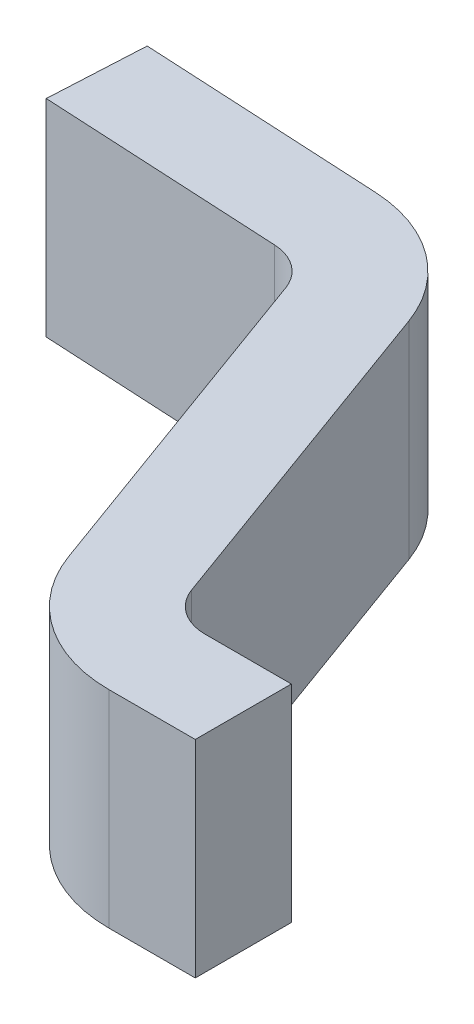
ISO-10303-21;
HEADER;
FILE_DESCRIPTION(('STEP AP214'),'2;1');
FILE_NAME('part.step','',(''),(''),'','','');
FILE_SCHEMA(('AUTOMOTIVE_DESIGN { 1 0 10303 214 1 1 1 1 }'));
ENDSEC;
DATA;
#1=APPLICATION_CONTEXT('core data for automotive mechanical design processes');
#2=APPLICATION_PROTOCOL_DEFINITION('international standard','automotive_design',2000,#1);
#3=PRODUCT_CONTEXT('',#1,'mechanical');
#4=PRODUCT('Part','Part','',(#3));
#5=PRODUCT_RELATED_PRODUCT_CATEGORY('part','',(#4));
#6=PRODUCT_DEFINITION_FORMATION('','',#4);
#7=PRODUCT_DEFINITION_CONTEXT('part definition',#1,'design');
#8=PRODUCT_DEFINITION('design','',#6,#7);
#9=PRODUCT_DEFINITION_SHAPE('','',#8);
#10=(LENGTH_UNIT() NAMED_UNIT(*) SI_UNIT(.MILLI.,.METRE.));
#11=(NAMED_UNIT(*) PLANE_ANGLE_UNIT() SI_UNIT($,.RADIAN.));
#12=(NAMED_UNIT(*) SI_UNIT($,.STERADIAN.) SOLID_ANGLE_UNIT());
#13=UNCERTAINTY_MEASURE_WITH_UNIT(LENGTH_MEASURE(1.E-05),#10,'distance_accuracy_value','');
#14=(GEOMETRIC_REPRESENTATION_CONTEXT(3) GLOBAL_UNCERTAINTY_ASSIGNED_CONTEXT((#13)) GLOBAL_UNIT_ASSIGNED_CONTEXT((#10,
#11,#12)) REPRESENTATION_CONTEXT('',''));
#15=CARTESIAN_POINT('',(0.,0.,0.));
#16=DIRECTION('',(0.,0.,1.));
#17=DIRECTION('',(1.,0.,0.));
#18=AXIS2_PLACEMENT_3D('',#15,#16,#17);
#19=CARTESIAN_POINT('',(0.48600567211583,0.,0.323785336125864));
#20=DIRECTION('',(0.,-1.,0.));
#21=DIRECTION('',(0.,0.,-1.));
#22=AXIS2_PLACEMENT_3D('',#19,#20,#21);
#23=PLANE('',#22);
#24=DIRECTION('',(0.998629534754574,0.,0.052335956242944));
#25=VECTOR('',#24,1.);
#26=CARTESIAN_POINT('',(0.491239267740124,0.,0.223922382650406));
#27=LINE('',#26,#25);
#28=CARTESIAN_POINT('',(-0.010467191248589,0.,0.19762906128285));
#29=VERTEX_POINT('',#28);
#30=CARTESIAN_POINT('',(0.491239267740124,0.,0.223922382650406));
#31=VERTEX_POINT('',#30);
#32=EDGE_CURVE('E280',#29,#31,#27,.T.);
#33=ORIENTED_EDGE('',*,*,#32,.T.);
#34=CARTESIAN_POINT('',(0.48600567211583,0.,0.323785336125864));
#35=DIRECTION('',(0.,-1.,0.));
#36=DIRECTION('',(0.,0.,1.));
#37=AXIS2_PLACEMENT_3D('',#34,#35,#36);
#38=CIRCLE('',#37,0.1);
#39=CARTESIAN_POINT('',(0.57997493419442,0.,0.289583321793297));
#40=VERTEX_POINT('',#39);
#41=EDGE_CURVE('E199',#31,#40,#38,.T.);
#42=ORIENTED_EDGE('',*,*,#41,.T.);
#43=DIRECTION('',(0.342020143325669,0.,0.939692620785908));
#44=VECTOR('',#43,1.);
#45=CARTESIAN_POINT('',(0.838730791659287,0.,1.00050919732964));
#46=LINE('',#45,#44);
#47=CARTESIAN_POINT('',(0.838730791659286,0.,1.00050919732964));
#48=VERTEX_POINT('',#47);
#49=EDGE_CURVE('E207',#40,#48,#46,.T.);
#50=ORIENTED_EDGE('',*,*,#49,.T.);
#51=CARTESIAN_POINT('',(1.12063857789506,0.,0.897903154331935));
#52=DIRECTION('',(0.,-1.,0.));
#53=DIRECTION('',(0.,0.,1.));
#54=AXIS2_PLACEMENT_3D('',#51,#52,#53);
#55=CIRCLE('',#54,0.3);
#56=CARTESIAN_POINT('',(1.12063857789506,0.,1.19790315433193));
#57=VERTEX_POINT('',#56);
#58=EDGE_CURVE('E215',#57,#48,#55,.T.);
#59=ORIENTED_EDGE('',*,*,#58,.F.);
#60=DIRECTION('',(1.,0.,0.));
#61=VECTOR('',#60,1.);
#62=CARTESIAN_POINT('',(1.3,0.,1.19790315433193));
#63=LINE('',#62,#61);
#64=CARTESIAN_POINT('',(1.3,0.,1.19790315433193));
#65=VERTEX_POINT('',#64);
#66=EDGE_CURVE('E221',#57,#65,#63,.T.);
#67=ORIENTED_EDGE('',*,*,#66,.T.);
#68=DIRECTION('',(0.,0.,-1.));
#69=VECTOR('',#68,1.);
#70=CARTESIAN_POINT('',(1.3,0.,0.997903154331935));
#71=LINE('',#70,#69);
#72=CARTESIAN_POINT('',(1.3,0.,0.997903154331935));
#73=VERTEX_POINT('',#72);
#74=EDGE_CURVE('E179',#65,#73,#71,.T.);
#75=ORIENTED_EDGE('',*,*,#74,.T.);
#76=DIRECTION('',(-1.,0.,0.));
#77=VECTOR('',#76,1.);
#78=CARTESIAN_POINT('',(1.12063857789506,0.,0.997903154331935));
#79=LINE('',#78,#77);
#80=CARTESIAN_POINT('',(1.12063857789506,0.,0.997903154331935));
#81=VERTEX_POINT('',#80);
#82=EDGE_CURVE('E178',#73,#81,#79,.T.);
#83=ORIENTED_EDGE('',*,*,#82,.T.);
#84=CARTESIAN_POINT('',(1.12063857789506,0.,0.897903154331935));
#85=DIRECTION('',(0.,-1.,0.));
#86=DIRECTION('',(0.,0.,1.));
#87=AXIS2_PLACEMENT_3D('',#84,#85,#86);
#88=CIRCLE('',#87,0.1);
#89=CARTESIAN_POINT('',(1.02666931581647,0.,0.932105168664502));
#90=VERTEX_POINT('',#89);
#91=EDGE_CURVE('E148',#81,#90,#88,.T.);
#92=ORIENTED_EDGE('',*,*,#91,.T.);
#93=DIRECTION('',(-0.342020143325669,0.,-0.939692620785908));
#94=VECTOR('',#93,1.);
#95=CARTESIAN_POINT('',(0.767913458351602,0.,0.221179293128163));
#96=LINE('',#95,#94);
#97=CARTESIAN_POINT('',(0.767913458351602,0.,0.221179293128163));
#98=VERTEX_POINT('',#97);
#99=EDGE_CURVE('E147',#90,#98,#96,.T.);
#100=ORIENTED_EDGE('',*,*,#99,.T.);
#101=CARTESIAN_POINT('',(0.48600567211583,0.,0.323785336125864));
#102=DIRECTION('',(0.,-1.,0.));
#103=DIRECTION('',(0.,0.,1.));
#104=AXIS2_PLACEMENT_3D('',#101,#102,#103);
#105=CIRCLE('',#104,0.3);
#106=CARTESIAN_POINT('',(0.501706458988713,0.,0.0241964756994916));
#107=VERTEX_POINT('',#106);
#108=EDGE_CURVE('E143',#107,#98,#105,.T.);
#109=ORIENTED_EDGE('',*,*,#108,.F.);
#110=DIRECTION('',(-0.998629534754574,0.,-0.052335956242944));
#111=VECTOR('',#110,1.);
#112=CARTESIAN_POINT('',(0.,0.,-0.00209684566806524));
#113=LINE('',#112,#111);
#114=CARTESIAN_POINT('',(0.,0.,-0.00209684566806525));
#115=VERTEX_POINT('',#114);
#116=EDGE_CURVE('E26',#107,#115,#113,.T.);
#117=ORIENTED_EDGE('',*,*,#116,.T.);
#118=DIRECTION('',(-0.0523359562429441,0.,0.998629534754574));
#119=VECTOR('',#118,1.);
#120=CARTESIAN_POINT('',(-0.0104671912485889,0.,0.19762906128285));
#121=LINE('',#120,#119);
#122=EDGE_CURVE('E11',#115,#29,#121,.T.);
#123=ORIENTED_EDGE('',*,*,#122,.T.);
#124=EDGE_LOOP('',(#33,#42,#50,#59,#67,#75,#83,#92,#100,#109,#117,#123));
#125=FACE_BOUND('',#124,.T.);
#126=ADVANCED_FACE('F17',(#125),#23,.F.);
#127=CARTESIAN_POINT('',(-0.0104671912485889,-0.43,0.19762906128285));
#128=DIRECTION('',(0.998629534754574,0.,0.0523359562429441));
#129=DIRECTION('',(0.,-1.,0.));
#130=AXIS2_PLACEMENT_3D('',#127,#128,#129);
#131=PLANE('',#130);
#132=DIRECTION('',(0.,-1.,0.));
#133=VECTOR('',#132,1.);
#134=CARTESIAN_POINT('',(0.,-0.43,-0.00209684566806524));
#135=LINE('',#134,#133);
#136=CARTESIAN_POINT('',(0.,-0.43,-0.00209684566806522));
#137=VERTEX_POINT('',#136);
#138=EDGE_CURVE('E244',#115,#137,#135,.T.);
#139=ORIENTED_EDGE('',*,*,#138,.T.);
#140=DIRECTION('',(0.0523359562429436,0.,-0.998629534754574));
#141=VECTOR('',#140,1.);
#142=CARTESIAN_POINT('',(-0.0104671912485889,-0.43,0.19762906128285));
#143=LINE('',#142,#141);
#144=CARTESIAN_POINT('',(-0.0104671912485889,-0.43,0.19762906128285));
#145=VERTEX_POINT('',#144);
#146=EDGE_CURVE('E172',#145,#137,#143,.T.);
#147=ORIENTED_EDGE('',*,*,#146,.F.);
#148=DIRECTION('',(0.,1.,0.));
#149=VECTOR('',#148,1.);
#150=CARTESIAN_POINT('',(-0.010467191248589,-0.43,0.197629061282849));
#151=LINE('',#150,#149);
#152=EDGE_CURVE('E198',#145,#29,#151,.T.);
#153=ORIENTED_EDGE('',*,*,#152,.T.);
#154=ORIENTED_EDGE('',*,*,#122,.F.);
#155=EDGE_LOOP('',(#139,#147,#153,#154));
#156=FACE_BOUND('',#155,.T.);
#157=ADVANCED_FACE('F254',(#156),#131,.F.);
#158=CARTESIAN_POINT('',(0.,-0.43,-0.00209684566806524));
#159=DIRECTION('',(-0.052335956242944,0.,0.998629534754574));
#160=DIRECTION('',(0.,1.,0.));
#161=AXIS2_PLACEMENT_3D('',#158,#159,#160);
#162=PLANE('',#161);
#163=DIRECTION('',(0.,1.,0.));
#164=VECTOR('',#163,1.);
#165=CARTESIAN_POINT('',(0.501706458988713,-0.43,0.0241964756994918));
#166=LINE('',#165,#164);
#167=CARTESIAN_POINT('',(0.501706458988713,-0.43,0.0241964756994917));
#168=VERTEX_POINT('',#167);
#169=EDGE_CURVE('E241',#168,#107,#166,.T.);
#170=ORIENTED_EDGE('',*,*,#169,.F.);
#171=DIRECTION('',(0.998629534754574,0.,0.0523359562429439));
#172=VECTOR('',#171,1.);
#173=CARTESIAN_POINT('',(0.,-0.43,-0.00209684566806519));
#174=LINE('',#173,#172);
#175=EDGE_CURVE('E165',#137,#168,#174,.T.);
#176=ORIENTED_EDGE('',*,*,#175,.F.);
#177=ORIENTED_EDGE('',*,*,#138,.F.);
#178=ORIENTED_EDGE('',*,*,#116,.F.);
#179=EDGE_LOOP('',(#170,#176,#177,#178));
#180=FACE_BOUND('',#179,.T.);
#181=ADVANCED_FACE('F252',(#180),#162,.F.);
#182=CARTESIAN_POINT('',(0.48600567211583,-0.43,0.323785336125864));
#183=DIRECTION('',(0.,1.,0.));
#184=DIRECTION('',(0.,0.,1.));
#185=AXIS2_PLACEMENT_3D('',#182,#183,#184);
#186=CYLINDRICAL_SURFACE('',#185,0.3);
#187=CARTESIAN_POINT('',(0.48600567211583,-0.43,0.323785336125864));
#188=DIRECTION('',(0.,-1.,0.));
#189=DIRECTION('',(0.,0.,1.));
#190=AXIS2_PLACEMENT_3D('',#187,#188,#189);
#191=CIRCLE('',#190,0.3);
#192=CARTESIAN_POINT('',(0.767913458351602,-0.43,0.221179293128163));
#193=VERTEX_POINT('',#192);
#194=EDGE_CURVE('E141',#168,#193,#191,.T.);
#195=ORIENTED_EDGE('',*,*,#194,.F.);
#196=ORIENTED_EDGE('',*,*,#169,.T.);
#197=ORIENTED_EDGE('',*,*,#108,.T.);
#198=DIRECTION('',(0.,-1.,0.));
#199=VECTOR('',#198,1.);
#200=CARTESIAN_POINT('',(0.767913458351602,-0.43,0.221179293128163));
#201=LINE('',#200,#199);
#202=EDGE_CURVE('E137',#98,#193,#201,.T.);
#203=ORIENTED_EDGE('',*,*,#202,.T.);
#204=EDGE_LOOP('',(#195,#196,#197,#203));
#205=FACE_BOUND('',#204,.T.);
#206=ADVANCED_FACE('F19',(#205),#186,.T.);
#207=CARTESIAN_POINT('',(0.767913458351602,-0.43,0.221179293128163));
#208=DIRECTION('',(-0.939692620785908,0.,0.342020143325669));
#209=DIRECTION('',(0.,1.,0.));
#210=AXIS2_PLACEMENT_3D('',#207,#208,#209);
#211=PLANE('',#210);
#212=DIRECTION('',(0.,-1.,0.));
#213=VECTOR('',#212,1.);
#214=CARTESIAN_POINT('',(1.02666931581647,-0.43,0.932105168664502));
#215=LINE('',#214,#213);
#216=CARTESIAN_POINT('',(1.02666931581647,-0.43,0.932105168664502));
#217=VERTEX_POINT('',#216);
#218=EDGE_CURVE('E154',#90,#217,#215,.T.);
#219=ORIENTED_EDGE('',*,*,#218,.T.);
#220=DIRECTION('',(0.342020143325671,0.,0.939692620785908));
#221=VECTOR('',#220,1.);
#222=CARTESIAN_POINT('',(0.767913458351602,-0.43,0.221179293128163));
#223=LINE('',#222,#221);
#224=EDGE_CURVE('E151',#193,#217,#223,.T.);
#225=ORIENTED_EDGE('',*,*,#224,.F.);
#226=ORIENTED_EDGE('',*,*,#202,.F.);
#227=ORIENTED_EDGE('',*,*,#99,.F.);
#228=EDGE_LOOP('',(#219,#225,#226,#227));
#229=FACE_BOUND('',#228,.T.);
#230=ADVANCED_FACE('F152',(#229),#211,.F.);
#231=CARTESIAN_POINT('',(1.12063857789506,-0.43,0.897903154331935));
#232=DIRECTION('',(0.,1.,0.));
#233=DIRECTION('',(0.,0.,1.));
#234=AXIS2_PLACEMENT_3D('',#231,#232,#233);
#235=CYLINDRICAL_SURFACE('',#234,0.1);
#236=DIRECTION('',(0.,-1.,0.));
#237=VECTOR('',#236,1.);
#238=CARTESIAN_POINT('',(1.12063857789506,-0.43,0.997903154331935));
#239=LINE('',#238,#237);
#240=CARTESIAN_POINT('',(1.12063857789506,-0.43,0.997903154331935));
#241=VERTEX_POINT('',#240);
#242=EDGE_CURVE('E176',#81,#241,#239,.T.);
#243=ORIENTED_EDGE('',*,*,#242,.T.);
#244=CARTESIAN_POINT('',(1.12063857789506,-0.43,0.897903154331935));
#245=DIRECTION('',(0.,1.,0.));
#246=DIRECTION('',(0.,0.,1.));
#247=AXIS2_PLACEMENT_3D('',#244,#245,#246);
#248=CIRCLE('',#247,0.1);
#249=EDGE_CURVE('E159',#217,#241,#248,.T.);
#250=ORIENTED_EDGE('',*,*,#249,.F.);
#251=ORIENTED_EDGE('',*,*,#218,.F.);
#252=ORIENTED_EDGE('',*,*,#91,.F.);
#253=EDGE_LOOP('',(#243,#250,#251,#252));
#254=FACE_BOUND('',#253,.T.);
#255=ADVANCED_FACE('F487',(#254),#235,.F.);
#256=CARTESIAN_POINT('',(1.12063857789506,-0.43,0.997903154331935));
#257=DIRECTION('',(0.,0.,1.));
#258=DIRECTION('',(1.,0.,0.));
#259=AXIS2_PLACEMENT_3D('',#256,#257,#258);
#260=PLANE('',#259);
#261=DIRECTION('',(0.,-1.,0.));
#262=VECTOR('',#261,1.);
#263=CARTESIAN_POINT('',(1.3,-0.43,0.997903154331935));
#264=LINE('',#263,#262);
#265=CARTESIAN_POINT('',(1.3,-0.43,0.997903154331935));
#266=VERTEX_POINT('',#265);
#267=EDGE_CURVE('E225',#73,#266,#264,.T.);
#268=ORIENTED_EDGE('',*,*,#267,.T.);
#269=DIRECTION('',(1.,0.,0.));
#270=VECTOR('',#269,1.);
#271=CARTESIAN_POINT('',(0.48600567211583,-0.43,0.997903154331935));
#272=LINE('',#271,#270);
#273=EDGE_CURVE('E181',#241,#266,#272,.T.);
#274=ORIENTED_EDGE('',*,*,#273,.F.);
#275=ORIENTED_EDGE('',*,*,#242,.F.);
#276=ORIENTED_EDGE('',*,*,#82,.F.);
#277=EDGE_LOOP('',(#268,#274,#275,#276));
#278=FACE_BOUND('',#277,.T.);
#279=ADVANCED_FACE('F481',(#278),#260,.F.);
#280=CARTESIAN_POINT('',(1.3,-0.43,0.997903154331935));
#281=DIRECTION('',(-1.,0.,0.));
#282=DIRECTION('',(0.,0.,1.));
#283=AXIS2_PLACEMENT_3D('',#280,#281,#282);
#284=PLANE('',#283);
#285=DIRECTION('',(0.,-1.,0.));
#286=VECTOR('',#285,1.);
#287=CARTESIAN_POINT('',(1.3,-0.43,1.19790315433193));
#288=LINE('',#287,#286);
#289=CARTESIAN_POINT('',(1.3,-0.43,1.19790315433193));
#290=VERTEX_POINT('',#289);
#291=EDGE_CURVE('E218',#65,#290,#288,.T.);
#292=ORIENTED_EDGE('',*,*,#291,.T.);
#293=DIRECTION('',(0.,0.,1.));
#294=VECTOR('',#293,1.);
#295=CARTESIAN_POINT('',(1.3,-0.43,0.323785336125864));
#296=LINE('',#295,#294);
#297=EDGE_CURVE('E185',#266,#290,#296,.T.);
#298=ORIENTED_EDGE('',*,*,#297,.F.);
#299=ORIENTED_EDGE('',*,*,#267,.F.);
#300=ORIENTED_EDGE('',*,*,#74,.F.);
#301=EDGE_LOOP('',(#292,#298,#299,#300));
#302=FACE_BOUND('',#301,.T.);
#303=ADVANCED_FACE('F486',(#302),#284,.F.);
#304=CARTESIAN_POINT('',(1.3,-0.43,1.19790315433193));
#305=DIRECTION('',(0.,0.,-1.));
#306=DIRECTION('',(-1.,0.,0.));
#307=AXIS2_PLACEMENT_3D('',#304,#305,#306);
#308=PLANE('',#307);
#309=DIRECTION('',(0.,1.,0.));
#310=VECTOR('',#309,1.);
#311=CARTESIAN_POINT('',(1.12063857789506,-0.43,1.19790315433193));
#312=LINE('',#311,#310);
#313=CARTESIAN_POINT('',(1.12063857789506,-0.43,1.19790315433193));
#314=VERTEX_POINT('',#313);
#315=EDGE_CURVE('E211',#314,#57,#312,.T.);
#316=ORIENTED_EDGE('',*,*,#315,.F.);
#317=DIRECTION('',(-1.,0.,0.));
#318=VECTOR('',#317,1.);
#319=CARTESIAN_POINT('',(0.48600567211583,-0.43,1.19790315433193));
#320=LINE('',#319,#318);
#321=EDGE_CURVE('E189',#290,#314,#320,.T.);
#322=ORIENTED_EDGE('',*,*,#321,.F.);
#323=ORIENTED_EDGE('',*,*,#291,.F.);
#324=ORIENTED_EDGE('',*,*,#66,.F.);
#325=EDGE_LOOP('',(#316,#322,#323,#324));
#326=FACE_BOUND('',#325,.T.);
#327=ADVANCED_FACE('F517',(#326),#308,.F.);
#328=CARTESIAN_POINT('',(1.12063857789506,-0.43,0.897903154331935));
#329=DIRECTION('',(0.,1.,0.));
#330=DIRECTION('',(0.,0.,1.));
#331=AXIS2_PLACEMENT_3D('',#328,#329,#330);
#332=CYLINDRICAL_SURFACE('',#331,0.3);
#333=CARTESIAN_POINT('',(1.12063857789506,-0.43,0.897903154331935));
#334=DIRECTION('',(0.,-1.,0.));
#335=DIRECTION('',(0.,0.,1.));
#336=AXIS2_PLACEMENT_3D('',#333,#334,#335);
#337=CIRCLE('',#336,0.3);
#338=CARTESIAN_POINT('',(0.838730791659286,-0.43,1.00050919732964));
#339=VERTEX_POINT('',#338);
#340=EDGE_CURVE('E193',#314,#339,#337,.T.);
#341=ORIENTED_EDGE('',*,*,#340,.F.);
#342=ORIENTED_EDGE('',*,*,#315,.T.);
#343=ORIENTED_EDGE('',*,*,#58,.T.);
#344=DIRECTION('',(0.,-1.,0.));
#345=VECTOR('',#344,1.);
#346=CARTESIAN_POINT('',(0.838730791659287,-0.43,1.00050919732964));
#347=LINE('',#346,#345);
#348=EDGE_CURVE('E203',#48,#339,#347,.T.);
#349=ORIENTED_EDGE('',*,*,#348,.T.);
#350=EDGE_LOOP('',(#341,#342,#343,#349));
#351=FACE_BOUND('',#350,.T.);
#352=ADVANCED_FACE('F522',(#351),#332,.T.);
#353=CARTESIAN_POINT('',(0.838730791659287,-0.43,1.00050919732964));
#354=DIRECTION('',(0.939692620785908,0.,-0.342020143325669));
#355=DIRECTION('',(0.,-1.,0.));
#356=AXIS2_PLACEMENT_3D('',#353,#354,#355);
#357=PLANE('',#356);
#358=DIRECTION('',(0.,-1.,0.));
#359=VECTOR('',#358,1.);
#360=CARTESIAN_POINT('',(0.579974934194421,-0.43,0.289583321793297));
#361=LINE('',#360,#359);
#362=CARTESIAN_POINT('',(0.579974934194421,-0.43,0.289583321793297));
#363=VERTEX_POINT('',#362);
#364=EDGE_CURVE('E204',#40,#363,#361,.T.);
#365=ORIENTED_EDGE('',*,*,#364,.T.);
#366=DIRECTION('',(-0.342020143325667,0.,-0.939692620785909));
#367=VECTOR('',#366,1.);
#368=CARTESIAN_POINT('',(0.838730791659287,-0.43,1.00050919732964));
#369=LINE('',#368,#367);
#370=EDGE_CURVE('E194',#339,#363,#369,.T.);
#371=ORIENTED_EDGE('',*,*,#370,.F.);
#372=ORIENTED_EDGE('',*,*,#348,.F.);
#373=ORIENTED_EDGE('',*,*,#49,.F.);
#374=EDGE_LOOP('',(#365,#371,#372,#373));
#375=FACE_BOUND('',#374,.T.);
#376=ADVANCED_FACE('F449',(#375),#357,.F.);
#377=CARTESIAN_POINT('',(0.48600567211583,-0.43,0.323785336125864));
#378=DIRECTION('',(0.,1.,0.));
#379=DIRECTION('',(0.,0.,1.));
#380=AXIS2_PLACEMENT_3D('',#377,#378,#379);
#381=CYLINDRICAL_SURFACE('',#380,0.1);
#382=DIRECTION('',(0.,-1.,0.));
#383=VECTOR('',#382,1.);
#384=CARTESIAN_POINT('',(0.491239267740124,-0.43,0.223922382650406));
#385=LINE('',#384,#383);
#386=CARTESIAN_POINT('',(0.491239267740124,-0.43,0.223922382650406));
#387=VERTEX_POINT('',#386);
#388=EDGE_CURVE('E277',#31,#387,#385,.T.);
#389=ORIENTED_EDGE('',*,*,#388,.T.);
#390=CARTESIAN_POINT('',(0.48600567211583,-0.43,0.323785336125864));
#391=DIRECTION('',(0.,1.,0.));
#392=DIRECTION('',(0.,0.,1.));
#393=AXIS2_PLACEMENT_3D('',#390,#391,#392);
#394=CIRCLE('',#393,0.1);
#395=EDGE_CURVE('E261',#363,#387,#394,.T.);
#396=ORIENTED_EDGE('',*,*,#395,.F.);
#397=ORIENTED_EDGE('',*,*,#364,.F.);
#398=ORIENTED_EDGE('',*,*,#41,.F.);
#399=EDGE_LOOP('',(#389,#396,#397,#398));
#400=FACE_BOUND('',#399,.T.);
#401=ADVANCED_FACE('F286',(#400),#381,.F.);
#402=CARTESIAN_POINT('',(0.491239267740124,-0.43,0.223922382650406));
#403=DIRECTION('',(0.052335956242944,0.,-0.998629534754574));
#404=DIRECTION('',(0.,-1.,0.));
#405=AXIS2_PLACEMENT_3D('',#402,#403,#404);
#406=PLANE('',#405);
#407=ORIENTED_EDGE('',*,*,#152,.F.);
#408=DIRECTION('',(-0.998629534754574,0.,-0.0523359562429426));
#409=VECTOR('',#408,1.);
#410=CARTESIAN_POINT('',(0.491239267740124,-0.43,0.223922382650406));
#411=LINE('',#410,#409);
#412=EDGE_CURVE('E257',#387,#145,#411,.T.);
#413=ORIENTED_EDGE('',*,*,#412,.F.);
#414=ORIENTED_EDGE('',*,*,#388,.F.);
#415=ORIENTED_EDGE('',*,*,#32,.F.);
#416=EDGE_LOOP('',(#407,#413,#414,#415));
#417=FACE_BOUND('',#416,.T.);
#418=ADVANCED_FACE('F288',(#417),#406,.F.);
#419=CARTESIAN_POINT('',(0.48600567211583,-0.43,0.323785336125864));
#420=DIRECTION('',(0.,-1.,0.));
#421=DIRECTION('',(0.,0.,-1.));
#422=AXIS2_PLACEMENT_3D('',#419,#420,#421);
#423=PLANE('',#422);
#424=ORIENTED_EDGE('',*,*,#395,.T.);
#425=ORIENTED_EDGE('',*,*,#412,.T.);
#426=ORIENTED_EDGE('',*,*,#146,.T.);
#427=ORIENTED_EDGE('',*,*,#175,.T.);
#428=ORIENTED_EDGE('',*,*,#194,.T.);
#429=ORIENTED_EDGE('',*,*,#224,.T.);
#430=ORIENTED_EDGE('',*,*,#249,.T.);
#431=ORIENTED_EDGE('',*,*,#273,.T.);
#432=ORIENTED_EDGE('',*,*,#297,.T.);
#433=ORIENTED_EDGE('',*,*,#321,.T.);
#434=ORIENTED_EDGE('',*,*,#340,.T.);
#435=ORIENTED_EDGE('',*,*,#370,.T.);
#436=EDGE_LOOP('',(#424,#425,#426,#427,#428,#429,#430,#431,#432,#433,#434,#435));
#437=FACE_BOUND('',#436,.T.);
#438=ADVANCED_FACE('F162',(#437),#423,.T.);
#439=CLOSED_SHELL('',(#126,#157,#181,#206,#230,#255,#279,#303,#327,#352,#376,#401,#418,#438));
#440=MANIFOLD_SOLID_BREP('B1',#439);
#441=ADVANCED_BREP_SHAPE_REPRESENTATION('',(#18,#440),#14);
#442=SHAPE_DEFINITION_REPRESENTATION(#9,#441);
ENDSEC;
END-ISO-10303-21;
